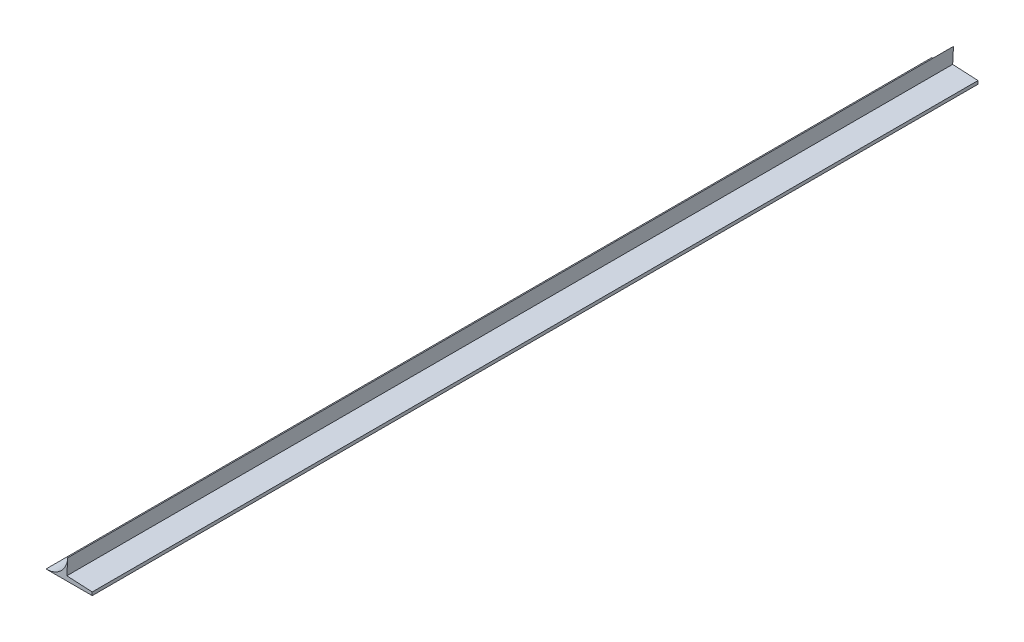
ISO-10303-21;
HEADER;
FILE_DESCRIPTION(('STEP AP214'),'2;1');
FILE_NAME('part.step','',(''),(''),'','','');
FILE_SCHEMA(('AUTOMOTIVE_DESIGN { 1 0 10303 214 1 1 1 1 }'));
ENDSEC;
DATA;
#1=APPLICATION_CONTEXT('core data for automotive mechanical design processes');
#2=APPLICATION_PROTOCOL_DEFINITION('international standard','automotive_design',2000,#1);
#3=PRODUCT_CONTEXT('',#1,'mechanical');
#4=PRODUCT('Part','Part','',(#3));
#5=PRODUCT_RELATED_PRODUCT_CATEGORY('part','',(#4));
#6=PRODUCT_DEFINITION_FORMATION('','',#4);
#7=PRODUCT_DEFINITION_CONTEXT('part definition',#1,'design');
#8=PRODUCT_DEFINITION('design','',#6,#7);
#9=PRODUCT_DEFINITION_SHAPE('','',#8);
#10=(LENGTH_UNIT() NAMED_UNIT(*) SI_UNIT(.MILLI.,.METRE.));
#11=(NAMED_UNIT(*) PLANE_ANGLE_UNIT() SI_UNIT($,.RADIAN.));
#12=(NAMED_UNIT(*) SI_UNIT($,.STERADIAN.) SOLID_ANGLE_UNIT());
#13=UNCERTAINTY_MEASURE_WITH_UNIT(LENGTH_MEASURE(1.E-05),#10,'distance_accuracy_value','');
#14=(GEOMETRIC_REPRESENTATION_CONTEXT(3) GLOBAL_UNCERTAINTY_ASSIGNED_CONTEXT((#13)) GLOBAL_UNIT_ASSIGNED_CONTEXT((#10,
#11,#12)) REPRESENTATION_CONTEXT('',''));
#15=CARTESIAN_POINT('',(0.,0.,0.));
#16=DIRECTION('',(0.,0.,1.));
#17=DIRECTION('',(1.,0.,0.));
#18=AXIS2_PLACEMENT_3D('',#15,#16,#17);
#19=CARTESIAN_POINT('',(13.48,12.79,550.));
#20=DIRECTION('',(0.998629534754574,-0.0523359562429355,0.));
#21=DIRECTION('',(0.0523359562429355,0.998629534754574,0.));
#22=AXIS2_PLACEMENT_3D('',#19,#20,#21);
#23=PLANE('',#22);
#24=DIRECTION('',(-0.0523359562429355,-0.998629534754574,0.));
#25=VECTOR('',#24,1.);
#26=CARTESIAN_POINT('',(13.48,12.79,0.));
#27=LINE('',#26,#25);
#28=CARTESIAN_POINT('',(13.48,12.79,0.));
#29=VERTEX_POINT('',#28);
#30=CARTESIAN_POINT('',(12.9577435606527,2.82475349476643,0.));
#31=VERTEX_POINT('',#30);
#32=EDGE_CURVE('E111',#29,#31,#27,.T.);
#33=ORIENTED_EDGE('',*,*,#32,.F.);
#34=DIRECTION('',(0.,0.,-1.));
#35=VECTOR('',#34,1.);
#36=CARTESIAN_POINT('',(13.48,12.79,550.));
#37=LINE('',#36,#35);
#38=CARTESIAN_POINT('',(13.48,12.79,550.));
#39=VERTEX_POINT('',#38);
#40=EDGE_CURVE('E11',#39,#29,#37,.T.);
#41=ORIENTED_EDGE('',*,*,#40,.F.);
#42=DIRECTION('',(-0.0523359562429355,-0.998629534754574,0.));
#43=VECTOR('',#42,1.);
#44=CARTESIAN_POINT('',(13.48,12.79,550.));
#45=LINE('',#44,#43);
#46=CARTESIAN_POINT('',(12.9577435606527,2.82475349476643,550.));
#47=VERTEX_POINT('',#46);
#48=EDGE_CURVE('E106',#39,#47,#45,.T.);
#49=ORIENTED_EDGE('',*,*,#48,.T.);
#50=DIRECTION('',(0.,0.,-1.));
#51=VECTOR('',#50,1.);
#52=CARTESIAN_POINT('',(12.9577435606527,2.82475349476643,550.));
#53=LINE('',#52,#51);
#54=EDGE_CURVE('E37',#47,#31,#53,.T.);
#55=ORIENTED_EDGE('',*,*,#54,.T.);
#56=EDGE_LOOP('',(#33,#41,#49,#55));
#57=FACE_BOUND('',#56,.T.);
#58=ADVANCED_FACE('F34',(#57),#23,.T.);
#59=CARTESIAN_POINT('',(-0.00131670465390241,13.4999999357885,550.));
#60=DIRECTION('',(0.,0.,-1.));
#61=DIRECTION('',(-1.,0.,0.));
#62=AXIS2_PLACEMENT_3D('',#59,#60,#61);
#63=CYLINDRICAL_SURFACE('',#62,13.5);
#64=CARTESIAN_POINT('',(-0.00131670465390241,13.4999999357885,0.));
#65=DIRECTION('',(0.,0.,-1.));
#66=DIRECTION('',(-1.,0.,0.));
#67=AXIS2_PLACEMENT_3D('',#64,#65,#66);
#68=CIRCLE('',#67,13.5);
#69=CARTESIAN_POINT('',(0.,0.,0.));
#70=VERTEX_POINT('',#69);
#71=EDGE_CURVE('E70',#29,#70,#68,.T.);
#72=ORIENTED_EDGE('',*,*,#71,.T.);
#73=DIRECTION('',(0.,0.,-1.));
#74=VECTOR('',#73,1.);
#75=CARTESIAN_POINT('',(0.,0.,550.));
#76=LINE('',#75,#74);
#77=CARTESIAN_POINT('',(0.,0.,550.));
#78=VERTEX_POINT('',#77);
#79=EDGE_CURVE('E43',#78,#70,#76,.T.);
#80=ORIENTED_EDGE('',*,*,#79,.F.);
#81=CARTESIAN_POINT('',(-0.00131670465390241,13.4999999357885,550.));
#82=DIRECTION('',(0.,0.,-1.));
#83=DIRECTION('',(-1.,0.,0.));
#84=AXIS2_PLACEMENT_3D('',#81,#82,#83);
#85=CIRCLE('',#84,13.5);
#86=EDGE_CURVE('E101',#39,#78,#85,.T.);
#87=ORIENTED_EDGE('',*,*,#86,.F.);
#88=ORIENTED_EDGE('',*,*,#40,.T.);
#89=EDGE_LOOP('',(#72,#80,#87,#88));
#90=FACE_BOUND('',#89,.T.);
#91=ADVANCED_FACE('F134',(#90),#63,.F.);
#92=CARTESIAN_POINT('',(0.,0.,550.));
#93=DIRECTION('',(0.,1.,0.));
#94=DIRECTION('',(-1.,0.,0.));
#95=AXIS2_PLACEMENT_3D('',#92,#93,#94);
#96=PLANE('',#95);
#97=DIRECTION('',(1.,0.,0.));
#98=VECTOR('',#97,1.);
#99=CARTESIAN_POINT('',(0.,0.,0.));
#100=LINE('',#99,#98);
#101=CARTESIAN_POINT('',(28.6949777279749,0.,0.));
#102=VERTEX_POINT('',#101);
#103=EDGE_CURVE('E92',#70,#102,#100,.T.);
#104=ORIENTED_EDGE('',*,*,#103,.T.);
#105=DIRECTION('',(0.,0.,-1.));
#106=VECTOR('',#105,1.);
#107=CARTESIAN_POINT('',(28.6949777279749,0.,550.));
#108=LINE('',#107,#106);
#109=CARTESIAN_POINT('',(28.6949777279749,0.,550.));
#110=VERTEX_POINT('',#109);
#111=EDGE_CURVE('E86',#110,#102,#108,.T.);
#112=ORIENTED_EDGE('',*,*,#111,.F.);
#113=DIRECTION('',(-1.,0.,0.));
#114=VECTOR('',#113,1.);
#115=CARTESIAN_POINT('',(28.6949777279749,0.,550.));
#116=LINE('',#115,#114);
#117=EDGE_CURVE('E89',#110,#78,#116,.T.);
#118=ORIENTED_EDGE('',*,*,#117,.T.);
#119=ORIENTED_EDGE('',*,*,#79,.T.);
#120=EDGE_LOOP('',(#104,#112,#118,#119));
#121=FACE_BOUND('',#120,.T.);
#122=ADVANCED_FACE('F88',(#121),#96,.F.);
#123=CARTESIAN_POINT('',(28.6949777279749,2.,550.));
#124=DIRECTION('',(1.,0.,0.));
#125=DIRECTION('',(0.,0.,-1.));
#126=AXIS2_PLACEMENT_3D('',#123,#124,#125);
#127=PLANE('',#126);
#128=DIRECTION('',(0.,-1.,0.));
#129=VECTOR('',#128,1.);
#130=CARTESIAN_POINT('',(28.6949777279749,2.,0.));
#131=LINE('',#130,#129);
#132=CARTESIAN_POINT('',(28.6949777279749,2.,0.));
#133=VERTEX_POINT('',#132);
#134=EDGE_CURVE('E117',#133,#102,#131,.T.);
#135=ORIENTED_EDGE('',*,*,#134,.F.);
#136=DIRECTION('',(0.,0.,-1.));
#137=VECTOR('',#136,1.);
#138=CARTESIAN_POINT('',(28.6949777279749,2.,550.));
#139=LINE('',#138,#137);
#140=CARTESIAN_POINT('',(28.6949777279749,2.,550.));
#141=VERTEX_POINT('',#140);
#142=EDGE_CURVE('E97',#141,#133,#139,.T.);
#143=ORIENTED_EDGE('',*,*,#142,.F.);
#144=DIRECTION('',(0.,-1.,0.));
#145=VECTOR('',#144,1.);
#146=CARTESIAN_POINT('',(28.6949777279749,2.,550.));
#147=LINE('',#146,#145);
#148=EDGE_CURVE('E100',#141,#110,#147,.T.);
#149=ORIENTED_EDGE('',*,*,#148,.T.);
#150=ORIENTED_EDGE('',*,*,#111,.T.);
#151=EDGE_LOOP('',(#135,#143,#149,#150));
#152=FACE_BOUND('',#151,.T.);
#153=ADVANCED_FACE('F104',(#152),#127,.T.);
#154=CARTESIAN_POINT('',(13.48,2.79738319456397,550.));
#155=DIRECTION('',(0.0523359562429358,0.998629534754574,0.));
#156=DIRECTION('',(-0.998629534754574,0.0523359562429358,0.));
#157=AXIS2_PLACEMENT_3D('',#154,#155,#156);
#158=PLANE('',#157);
#159=DIRECTION('',(0.998629534754574,-0.0523359562429358,0.));
#160=VECTOR('',#159,1.);
#161=CARTESIAN_POINT('',(13.48,2.79738319456397,0.));
#162=LINE('',#161,#160);
#163=EDGE_CURVE('E114',#31,#133,#162,.T.);
#164=ORIENTED_EDGE('',*,*,#163,.F.);
#165=ORIENTED_EDGE('',*,*,#54,.F.);
#166=DIRECTION('',(-0.998629534754574,0.0523359562429342,0.));
#167=VECTOR('',#166,1.);
#168=CARTESIAN_POINT('',(13.48,2.79738319456397,550.));
#169=LINE('',#168,#167);
#170=EDGE_CURVE('E80',#141,#47,#169,.T.);
#171=ORIENTED_EDGE('',*,*,#170,.F.);
#172=ORIENTED_EDGE('',*,*,#142,.T.);
#173=EDGE_LOOP('',(#164,#165,#171,#172));
#174=FACE_BOUND('',#173,.T.);
#175=ADVANCED_FACE('F125',(#174),#158,.T.);
#176=CARTESIAN_POINT('',(-0.00131670465390241,13.4999999357885,550.));
#177=DIRECTION('',(0.,0.,-1.));
#178=DIRECTION('',(-1.,0.,0.));
#179=AXIS2_PLACEMENT_3D('',#176,#177,#178);
#180=PLANE('',#179);
#181=ORIENTED_EDGE('',*,*,#48,.F.);
#182=ORIENTED_EDGE('',*,*,#86,.T.);
#183=ORIENTED_EDGE('',*,*,#117,.F.);
#184=ORIENTED_EDGE('',*,*,#148,.F.);
#185=ORIENTED_EDGE('',*,*,#170,.T.);
#186=EDGE_LOOP('',(#181,#182,#183,#184,#185));
#187=FACE_BOUND('',#186,.T.);
#188=ADVANCED_FACE('F99',(#187),#180,.F.);
#189=CARTESIAN_POINT('',(-0.00131670465390241,13.4999999357885,0.));
#190=DIRECTION('',(0.,0.,-1.));
#191=DIRECTION('',(-1.,0.,0.));
#192=AXIS2_PLACEMENT_3D('',#189,#190,#191);
#193=PLANE('',#192);
#194=ORIENTED_EDGE('',*,*,#32,.T.);
#195=ORIENTED_EDGE('',*,*,#163,.T.);
#196=ORIENTED_EDGE('',*,*,#134,.T.);
#197=ORIENTED_EDGE('',*,*,#103,.F.);
#198=ORIENTED_EDGE('',*,*,#71,.F.);
#199=EDGE_LOOP('',(#194,#195,#196,#197,#198));
#200=FACE_BOUND('',#199,.T.);
#201=ADVANCED_FACE('F124',(#200),#193,.T.);
#202=CLOSED_SHELL('',(#58,#91,#122,#153,#175,#188,#201));
#203=MANIFOLD_SOLID_BREP('B2',#202);
#204=ADVANCED_BREP_SHAPE_REPRESENTATION('',(#18,#203),#14);
#205=SHAPE_DEFINITION_REPRESENTATION(#9,#204);
ENDSEC;
END-ISO-10303-21;
